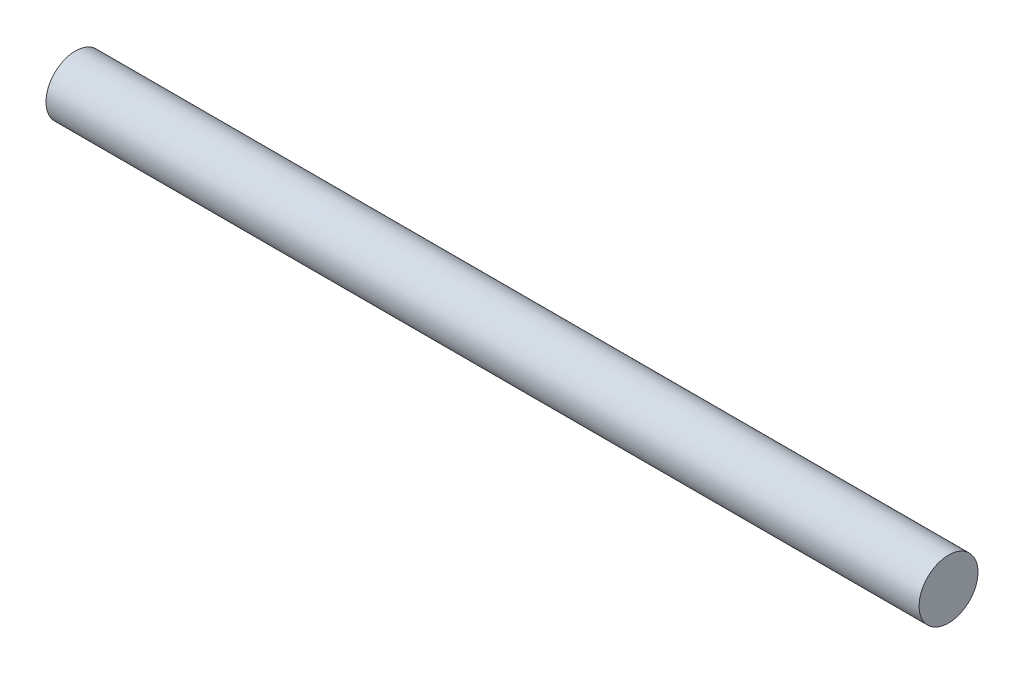
ISO-10303-21;
HEADER;
FILE_DESCRIPTION(('STEP AP214'),'2;1');
FILE_NAME('part.step','',(''),(''),'','','');
FILE_SCHEMA(('AUTOMOTIVE_DESIGN { 1 0 10303 214 1 1 1 1 }'));
ENDSEC;
DATA;
#1=APPLICATION_CONTEXT('core data for automotive mechanical design processes');
#2=APPLICATION_PROTOCOL_DEFINITION('international standard','automotive_design',2000,#1);
#3=PRODUCT_CONTEXT('',#1,'mechanical');
#4=PRODUCT('Part','Part','',(#3));
#5=PRODUCT_RELATED_PRODUCT_CATEGORY('part','',(#4));
#6=PRODUCT_DEFINITION_FORMATION('','',#4);
#7=PRODUCT_DEFINITION_CONTEXT('part definition',#1,'design');
#8=PRODUCT_DEFINITION('design','',#6,#7);
#9=PRODUCT_DEFINITION_SHAPE('','',#8);
#10=(LENGTH_UNIT() NAMED_UNIT(*) SI_UNIT(.MILLI.,.METRE.));
#11=(NAMED_UNIT(*) PLANE_ANGLE_UNIT() SI_UNIT($,.RADIAN.));
#12=(NAMED_UNIT(*) SI_UNIT($,.STERADIAN.) SOLID_ANGLE_UNIT());
#13=UNCERTAINTY_MEASURE_WITH_UNIT(LENGTH_MEASURE(1.E-05),#10,'distance_accuracy_value','');
#14=(GEOMETRIC_REPRESENTATION_CONTEXT(3) GLOBAL_UNCERTAINTY_ASSIGNED_CONTEXT((#13)) GLOBAL_UNIT_ASSIGNED_CONTEXT((#10,
#11,#12)) REPRESENTATION_CONTEXT('',''));
#15=CARTESIAN_POINT('',(0.,0.,0.));
#16=DIRECTION('',(0.,0.,1.));
#17=DIRECTION('',(1.,0.,0.));
#18=AXIS2_PLACEMENT_3D('',#15,#16,#17);
#19=CARTESIAN_POINT('',(177.8,0.,0.));
#20=DIRECTION('',(-1.,0.,0.));
#21=DIRECTION('',(0.,0.,1.));
#22=AXIS2_PLACEMENT_3D('',#19,#20,#21);
#23=CYLINDRICAL_SURFACE('',#22,6.);
#24=CARTESIAN_POINT('',(177.8,0.,0.));
#25=DIRECTION('',(1.,0.,0.));
#26=DIRECTION('',(0.,0.,-1.));
#27=AXIS2_PLACEMENT_3D('',#24,#25,#26);
#28=CIRCLE('',#27,6.);
#29=CARTESIAN_POINT('',(177.8,0.,-6.));
#30=VERTEX_POINT('',#29);
#31=EDGE_CURVE('E10',#30,#30,#28,.T.);
#32=ORIENTED_EDGE('',*,*,#31,.F.);
#33=EDGE_LOOP('',(#32));
#34=FACE_BOUND('',#33,.T.);
#35=CARTESIAN_POINT('',(0.,0.,0.));
#36=DIRECTION('',(1.,0.,0.));
#37=DIRECTION('',(0.,0.,-1.));
#38=AXIS2_PLACEMENT_3D('',#35,#36,#37);
#39=CIRCLE('',#38,6.);
#40=CARTESIAN_POINT('',(0.,0.,-6.));
#41=VERTEX_POINT('',#40);
#42=EDGE_CURVE('E34',#41,#41,#39,.T.);
#43=ORIENTED_EDGE('',*,*,#42,.T.);
#44=EDGE_LOOP('',(#43));
#45=FACE_BOUND('',#44,.T.);
#46=ADVANCED_FACE('F31',(#34,#45),#23,.T.);
#47=CARTESIAN_POINT('',(177.8,0.,0.));
#48=DIRECTION('',(1.,0.,0.));
#49=DIRECTION('',(0.,0.,-1.));
#50=AXIS2_PLACEMENT_3D('',#47,#48,#49);
#51=PLANE('',#50);
#52=ORIENTED_EDGE('',*,*,#31,.T.);
#53=EDGE_LOOP('',(#52));
#54=FACE_BOUND('',#53,.T.);
#55=ADVANCED_FACE('F46',(#54),#51,.T.);
#56=CARTESIAN_POINT('',(0.,0.,0.));
#57=DIRECTION('',(1.,0.,0.));
#58=DIRECTION('',(0.,0.,-1.));
#59=AXIS2_PLACEMENT_3D('',#56,#57,#58);
#60=PLANE('',#59);
#61=ORIENTED_EDGE('',*,*,#42,.F.);
#62=EDGE_LOOP('',(#61));
#63=FACE_BOUND('',#62,.T.);
#64=ADVANCED_FACE('F44',(#63),#60,.F.);
#65=CLOSED_SHELL('',(#46,#55,#64));
#66=MANIFOLD_SOLID_BREP('B2',#65);
#67=ADVANCED_BREP_SHAPE_REPRESENTATION('',(#18,#66),#14);
#68=SHAPE_DEFINITION_REPRESENTATION(#9,#67);
ENDSEC;
END-ISO-10303-21;
